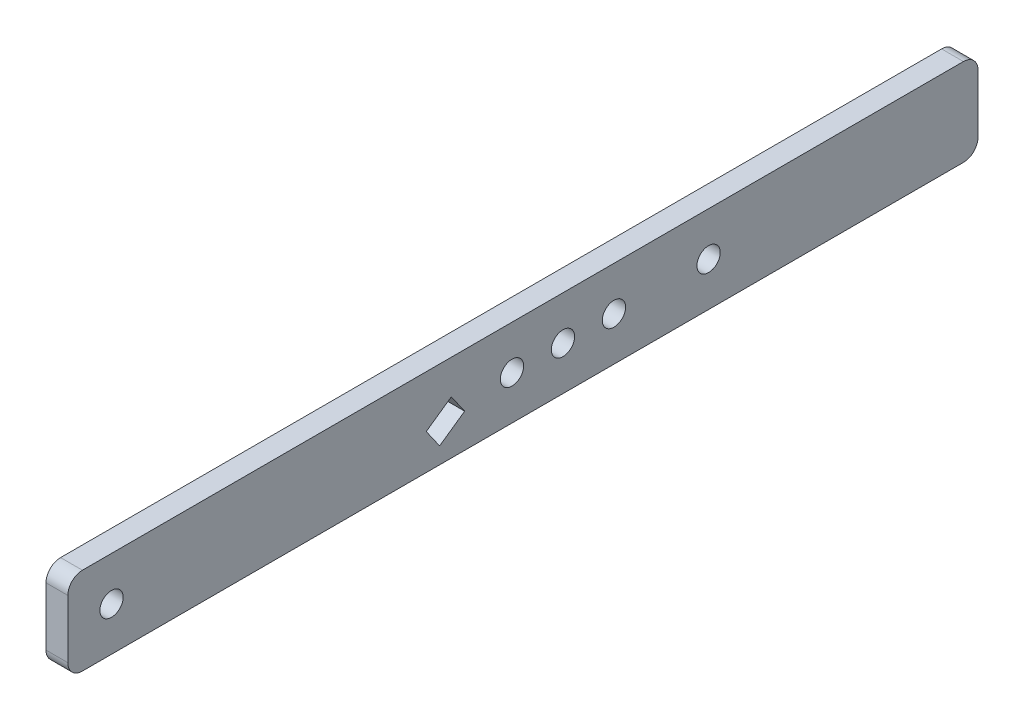
ISO-10303-21;
HEADER;
FILE_DESCRIPTION(('STEP AP214'),'2;1');
FILE_NAME('part.step','',(''),(''),'','','');
FILE_SCHEMA(('AUTOMOTIVE_DESIGN { 1 0 10303 214 1 1 1 1 }'));
ENDSEC;
DATA;
#1=APPLICATION_CONTEXT('core data for automotive mechanical design processes');
#2=APPLICATION_PROTOCOL_DEFINITION('international standard','automotive_design',2000,#1);
#3=PRODUCT_CONTEXT('',#1,'mechanical');
#4=PRODUCT('Part','Part','',(#3));
#5=PRODUCT_RELATED_PRODUCT_CATEGORY('part','',(#4));
#6=PRODUCT_DEFINITION_FORMATION('','',#4);
#7=PRODUCT_DEFINITION_CONTEXT('part definition',#1,'design');
#8=PRODUCT_DEFINITION('design','',#6,#7);
#9=PRODUCT_DEFINITION_SHAPE('','',#8);
#10=(LENGTH_UNIT() NAMED_UNIT(*) SI_UNIT(.MILLI.,.METRE.));
#11=(NAMED_UNIT(*) PLANE_ANGLE_UNIT() SI_UNIT($,.RADIAN.));
#12=(NAMED_UNIT(*) SI_UNIT($,.STERADIAN.) SOLID_ANGLE_UNIT());
#13=UNCERTAINTY_MEASURE_WITH_UNIT(LENGTH_MEASURE(1.E-05),#10,'distance_accuracy_value','');
#14=(GEOMETRIC_REPRESENTATION_CONTEXT(3) GLOBAL_UNCERTAINTY_ASSIGNED_CONTEXT((#13)) GLOBAL_UNIT_ASSIGNED_CONTEXT((#10,
#11,#12)) REPRESENTATION_CONTEXT('',''));
#15=CARTESIAN_POINT('',(0.,0.,0.));
#16=DIRECTION('',(0.,0.,1.));
#17=DIRECTION('',(1.,0.,0.));
#18=AXIS2_PLACEMENT_3D('',#15,#16,#17);
#19=CARTESIAN_POINT('',(55.,0.,-200.));
#20=DIRECTION('',(1.,0.,0.));
#21=DIRECTION('',(0.,0.,1.));
#22=AXIS2_PLACEMENT_3D('',#19,#20,#21);
#23=CYLINDRICAL_SURFACE('',#22,8.);
#24=CARTESIAN_POINT('',(39.9999999999997,0.,-200.));
#25=DIRECTION('',(-1.,0.,0.));
#26=DIRECTION('',(0.,0.,1.));
#27=AXIS2_PLACEMENT_3D('',#24,#25,#26);
#28=CIRCLE('',#27,8.);
#29=CARTESIAN_POINT('',(39.9999999999997,0.,-192.));
#30=VERTEX_POINT('',#29);
#31=EDGE_CURVE('E217',#30,#30,#28,.T.);
#32=ORIENTED_EDGE('',*,*,#31,.T.);
#33=EDGE_LOOP('',(#32));
#34=FACE_BOUND('',#33,.T.);
#35=CARTESIAN_POINT('',(55.,0.,-200.));
#36=DIRECTION('',(-1.,0.,0.));
#37=DIRECTION('',(0.,0.,1.));
#38=AXIS2_PLACEMENT_3D('',#35,#36,#37);
#39=CIRCLE('',#38,8.);
#40=CARTESIAN_POINT('',(55.,0.,-192.));
#41=VERTEX_POINT('',#40);
#42=EDGE_CURVE('E220',#41,#41,#39,.T.);
#43=ORIENTED_EDGE('',*,*,#42,.F.);
#44=EDGE_LOOP('',(#43));
#45=FACE_BOUND('',#44,.T.);
#46=ADVANCED_FACE('F41',(#34,#45),#23,.F.);
#47=CARTESIAN_POINT('',(55.,-30.0000000000005,-450.));
#48=DIRECTION('',(0.,1.,0.));
#49=DIRECTION('',(0.,0.,1.));
#50=AXIS2_PLACEMENT_3D('',#47,#48,#49);
#51=PLANE('',#50);
#52=DIRECTION('',(0.,0.,1.));
#53=VECTOR('',#52,1.);
#54=CARTESIAN_POINT('',(40.,-30.0000000000005,-450.));
#55=LINE('',#54,#53);
#56=CARTESIAN_POINT('',(40.,-30.0000000000005,-440.));
#57=VERTEX_POINT('',#56);
#58=CARTESIAN_POINT('',(40.,-30.0000000000005,165.));
#59=VERTEX_POINT('',#58);
#60=EDGE_CURVE('E195',#57,#59,#55,.T.);
#61=ORIENTED_EDGE('',*,*,#60,.F.);
#62=DIRECTION('',(1.,0.,0.));
#63=VECTOR('',#62,1.);
#64=CARTESIAN_POINT('',(55.,-30.0000000000005,-440.));
#65=LINE('',#64,#63);
#66=CARTESIAN_POINT('',(55.,-30.0000000000005,-440.));
#67=VERTEX_POINT('',#66);
#68=EDGE_CURVE('E223',#67,#57,#65,.F.);
#69=ORIENTED_EDGE('',*,*,#68,.F.);
#70=DIRECTION('',(0.,0.,1.));
#71=VECTOR('',#70,1.);
#72=CARTESIAN_POINT('',(55.,-30.0000000000005,-450.));
#73=LINE('',#72,#71);
#74=CARTESIAN_POINT('',(55.,-30.0000000000005,165.));
#75=VERTEX_POINT('',#74);
#76=EDGE_CURVE('E213',#67,#75,#73,.T.);
#77=ORIENTED_EDGE('',*,*,#76,.T.);
#78=DIRECTION('',(1.,0.,0.));
#79=VECTOR('',#78,1.);
#80=CARTESIAN_POINT('',(55.,-30.0000000000005,165.));
#81=LINE('',#80,#79);
#82=EDGE_CURVE('E226',#59,#75,#81,.T.);
#83=ORIENTED_EDGE('',*,*,#82,.F.);
#84=EDGE_LOOP('',(#61,#69,#77,#83));
#85=FACE_BOUND('',#84,.T.);
#86=ADVANCED_FACE('F291',(#85),#51,.F.);
#87=CARTESIAN_POINT('',(55.,-30.0000000000005,-450.));
#88=DIRECTION('',(-1.,0.,0.));
#89=DIRECTION('',(0.,0.,-1.));
#90=AXIS2_PLACEMENT_3D('',#87,#88,#89);
#91=PLANE('',#90);
#92=DIRECTION('',(0.,0.573576436351056,-0.819152044288984));
#93=VECTOR('',#92,1.);
#94=CARTESIAN_POINT('',(55.,-5.61297655954159,-71.1121153167902));
#95=LINE('',#94,#93);
#96=CARTESIAN_POINT('',(55.,-5.61297655954154,-71.1121153167902));
#97=VERTEX_POINT('',#96);
#98=CARTESIAN_POINT('',(55.,6.43212860383058,-88.3143082468588));
#99=VERTEX_POINT('',#98);
#100=EDGE_CURVE('E132',#97,#99,#95,.T.);
#101=ORIENTED_EDGE('',*,*,#100,.T.);
#102=DIRECTION('',(0.,-0.819152044288984,-0.573576436351057));
#103=VECTOR('',#102,1.);
#104=CARTESIAN_POINT('',(55.,6.43212860383058,-88.3143082468588));
#105=LINE('',#104,#103);
#106=CARTESIAN_POINT('',(55.,-6.67430410479316,-97.4915312284757));
#107=VERTEX_POINT('',#106);
#108=EDGE_CURVE('E139',#99,#107,#105,.T.);
#109=ORIENTED_EDGE('',*,*,#108,.T.);
#110=DIRECTION('',(0.,-0.573576436351057,0.819152044288984));
#111=VECTOR('',#110,1.);
#112=CARTESIAN_POINT('',(55.,-18.7194092681653,-80.2893382984071));
#113=LINE('',#112,#111);
#114=CARTESIAN_POINT('',(55.,-18.7194092681653,-80.2893382984071));
#115=VERTEX_POINT('',#114);
#116=EDGE_CURVE('E144',#107,#115,#113,.T.);
#117=ORIENTED_EDGE('',*,*,#116,.T.);
#118=DIRECTION('',(0.,0.819152044288984,0.573576436351057));
#119=VECTOR('',#118,1.);
#120=CARTESIAN_POINT('',(55.,-5.61297655954159,-71.1121153167902));
#121=LINE('',#120,#119);
#122=EDGE_CURVE('E148',#115,#97,#121,.T.);
#123=ORIENTED_EDGE('',*,*,#122,.T.);
#124=EDGE_LOOP('',(#101,#109,#117,#123));
#125=FACE_BOUND('',#124,.T.);
#126=CARTESIAN_POINT('',(55.,0.,-165.));
#127=DIRECTION('',(-1.,0.,0.));
#128=DIRECTION('',(0.,0.,1.));
#129=AXIS2_PLACEMENT_3D('',#126,#127,#128);
#130=CIRCLE('',#129,8.);
#131=CARTESIAN_POINT('',(55.,0.,-157.));
#132=VERTEX_POINT('',#131);
#133=EDGE_CURVE('E164',#132,#132,#130,.T.);
#134=ORIENTED_EDGE('',*,*,#133,.T.);
#135=EDGE_LOOP('',(#134));
#136=FACE_BOUND('',#135,.T.);
#137=CARTESIAN_POINT('',(55.,0.,-265.));
#138=DIRECTION('',(-1.,0.,0.));
#139=DIRECTION('',(0.,0.,1.));
#140=AXIS2_PLACEMENT_3D('',#137,#138,#139);
#141=CIRCLE('',#140,8.);
#142=CARTESIAN_POINT('',(55.,0.,-257.));
#143=VERTEX_POINT('',#142);
#144=EDGE_CURVE('E167',#143,#143,#141,.T.);
#145=ORIENTED_EDGE('',*,*,#144,.T.);
#146=EDGE_LOOP('',(#145));
#147=FACE_BOUND('',#146,.T.);
#148=CARTESIAN_POINT('',(55.,0.,-130.));
#149=DIRECTION('',(-1.,0.,0.));
#150=DIRECTION('',(0.,0.,1.));
#151=AXIS2_PLACEMENT_3D('',#148,#149,#150);
#152=CIRCLE('',#151,8.);
#153=CARTESIAN_POINT('',(55.,0.,-122.));
#154=VERTEX_POINT('',#153);
#155=EDGE_CURVE('E173',#154,#154,#152,.T.);
#156=ORIENTED_EDGE('',*,*,#155,.T.);
#157=EDGE_LOOP('',(#156));
#158=FACE_BOUND('',#157,.T.);
#159=CARTESIAN_POINT('',(55.,0.,145.));
#160=DIRECTION('',(-1.,0.,0.));
#161=DIRECTION('',(0.,0.,1.));
#162=AXIS2_PLACEMENT_3D('',#159,#160,#161);
#163=CIRCLE('',#162,8.);
#164=CARTESIAN_POINT('',(55.,0.,153.));
#165=VERTEX_POINT('',#164);
#166=EDGE_CURVE('E179',#165,#165,#163,.T.);
#167=ORIENTED_EDGE('',*,*,#166,.T.);
#168=EDGE_LOOP('',(#167));
#169=FACE_BOUND('',#168,.T.);
#170=ORIENTED_EDGE('',*,*,#76,.F.);
#171=CARTESIAN_POINT('',(55.,-20.0000000000005,-440.));
#172=DIRECTION('',(1.,0.,0.));
#173=DIRECTION('',(0.,0.,-1.));
#174=AXIS2_PLACEMENT_3D('',#171,#172,#173);
#175=CIRCLE('',#174,10.);
#176=CARTESIAN_POINT('',(55.,-20.0000000000005,-450.));
#177=VERTEX_POINT('',#176);
#178=EDGE_CURVE('E235',#177,#67,#175,.F.);
#179=ORIENTED_EDGE('',*,*,#178,.F.);
#180=DIRECTION('',(0.,1.,0.));
#181=VECTOR('',#180,1.);
#182=CARTESIAN_POINT('',(55.,-30.0000000000005,-450.));
#183=LINE('',#182,#181);
#184=CARTESIAN_POINT('',(55.,20.0000000000005,-450.));
#185=VERTEX_POINT('',#184);
#186=EDGE_CURVE('E186',#177,#185,#183,.T.);
#187=ORIENTED_EDGE('',*,*,#186,.T.);
#188=CARTESIAN_POINT('',(55.,20.0000000000005,-440.));
#189=DIRECTION('',(1.,0.,0.));
#190=DIRECTION('',(0.,0.,-1.));
#191=AXIS2_PLACEMENT_3D('',#188,#189,#190);
#192=CIRCLE('',#191,10.);
#193=CARTESIAN_POINT('',(55.,30.0000000000005,-440.));
#194=VERTEX_POINT('',#193);
#195=EDGE_CURVE('E232',#194,#185,#192,.F.);
#196=ORIENTED_EDGE('',*,*,#195,.F.);
#197=DIRECTION('',(0.,0.,1.));
#198=VECTOR('',#197,1.);
#199=CARTESIAN_POINT('',(55.,30.0000000000005,-450.));
#200=LINE('',#199,#198);
#201=CARTESIAN_POINT('',(55.,30.0000000000005,165.));
#202=VERTEX_POINT('',#201);
#203=EDGE_CURVE('E209',#194,#202,#200,.T.);
#204=ORIENTED_EDGE('',*,*,#203,.T.);
#205=CARTESIAN_POINT('',(55.,20.0000000000005,165.));
#206=DIRECTION('',(1.,0.,0.));
#207=DIRECTION('',(0.,0.,-1.));
#208=AXIS2_PLACEMENT_3D('',#205,#206,#207);
#209=CIRCLE('',#208,10.);
#210=CARTESIAN_POINT('',(55.,20.0000000000005,175.));
#211=VERTEX_POINT('',#210);
#212=EDGE_CURVE('E229',#211,#202,#209,.F.);
#213=ORIENTED_EDGE('',*,*,#212,.F.);
#214=DIRECTION('',(0.,1.,0.));
#215=VECTOR('',#214,1.);
#216=CARTESIAN_POINT('',(55.,-30.0000000000005,175.));
#217=LINE('',#216,#215);
#218=CARTESIAN_POINT('',(55.,-20.0000000000005,175.));
#219=VERTEX_POINT('',#218);
#220=EDGE_CURVE('E185',#219,#211,#217,.T.);
#221=ORIENTED_EDGE('',*,*,#220,.F.);
#222=CARTESIAN_POINT('',(55.,-20.0000000000005,165.));
#223=DIRECTION('',(1.,0.,0.));
#224=DIRECTION('',(0.,0.,-1.));
#225=AXIS2_PLACEMENT_3D('',#222,#223,#224);
#226=CIRCLE('',#225,10.);
#227=EDGE_CURVE('E237',#75,#219,#226,.F.);
#228=ORIENTED_EDGE('',*,*,#227,.F.);
#229=EDGE_LOOP('',(#170,#179,#187,#196,#204,#213,#221,#228));
#230=FACE_BOUND('',#229,.T.);
#231=ORIENTED_EDGE('',*,*,#42,.T.);
#232=EDGE_LOOP('',(#231));
#233=FACE_BOUND('',#232,.T.);
#234=ADVANCED_FACE('F146',(#125,#136,#147,#158,#169,#230,#233),#91,.F.);
#235=CARTESIAN_POINT('',(40.,30.0000000000005,-450.));
#236=DIRECTION('',(0.,-1.,0.));
#237=DIRECTION('',(0.,0.,-1.));
#238=AXIS2_PLACEMENT_3D('',#235,#236,#237);
#239=PLANE('',#238);
#240=DIRECTION('',(0.,0.,1.));
#241=VECTOR('',#240,1.);
#242=CARTESIAN_POINT('',(40.,30.0000000000005,-450.));
#243=LINE('',#242,#241);
#244=CARTESIAN_POINT('',(40.,30.0000000000005,-440.));
#245=VERTEX_POINT('',#244);
#246=CARTESIAN_POINT('',(40.,30.0000000000005,165.));
#247=VERTEX_POINT('',#246);
#248=EDGE_CURVE('E205',#245,#247,#243,.T.);
#249=ORIENTED_EDGE('',*,*,#248,.T.);
#250=DIRECTION('',(-1.,0.,0.));
#251=VECTOR('',#250,1.);
#252=CARTESIAN_POINT('',(40.,30.0000000000005,165.));
#253=LINE('',#252,#251);
#254=EDGE_CURVE('E49',#202,#247,#253,.T.);
#255=ORIENTED_EDGE('',*,*,#254,.F.);
#256=ORIENTED_EDGE('',*,*,#203,.F.);
#257=DIRECTION('',(-1.,0.,0.));
#258=VECTOR('',#257,1.);
#259=CARTESIAN_POINT('',(40.,30.0000000000005,-440.));
#260=LINE('',#259,#258);
#261=EDGE_CURVE('E11',#245,#194,#260,.F.);
#262=ORIENTED_EDGE('',*,*,#261,.F.);
#263=EDGE_LOOP('',(#249,#255,#256,#262));
#264=FACE_BOUND('',#263,.T.);
#265=ADVANCED_FACE('F265',(#264),#239,.F.);
#266=CARTESIAN_POINT('',(40.,-30.0000000000005,-450.));
#267=DIRECTION('',(1.,0.,0.));
#268=DIRECTION('',(0.,0.,1.));
#269=AXIS2_PLACEMENT_3D('',#266,#267,#268);
#270=PLANE('',#269);
#271=DIRECTION('',(0.,0.573576436351057,-0.819152044288984));
#272=VECTOR('',#271,1.);
#273=CARTESIAN_POINT('',(40.,-18.7194092681653,-80.2893382984071));
#274=LINE('',#273,#272);
#275=CARTESIAN_POINT('',(40.,-18.7194092681653,-80.2893382984071));
#276=VERTEX_POINT('',#275);
#277=CARTESIAN_POINT('',(40.,-6.67430410479316,-97.4915312284757));
#278=VERTEX_POINT('',#277);
#279=EDGE_CURVE('E350',#276,#278,#274,.T.);
#280=ORIENTED_EDGE('',*,*,#279,.T.);
#281=DIRECTION('',(0.,0.819152044288984,0.573576436351057));
#282=VECTOR('',#281,1.);
#283=CARTESIAN_POINT('',(40.,6.43212860383058,-88.3143082468588));
#284=LINE('',#283,#282);
#285=CARTESIAN_POINT('',(40.,6.43212860383061,-88.3143082468588));
#286=VERTEX_POINT('',#285);
#287=EDGE_CURVE('E156',#278,#286,#284,.T.);
#288=ORIENTED_EDGE('',*,*,#287,.T.);
#289=DIRECTION('',(0.,-0.573576436351057,0.819152044288984));
#290=VECTOR('',#289,1.);
#291=CARTESIAN_POINT('',(40.,-5.61297655954159,-71.1121153167902));
#292=LINE('',#291,#290);
#293=CARTESIAN_POINT('',(40.,-5.61297655954159,-71.1121153167902));
#294=VERTEX_POINT('',#293);
#295=EDGE_CURVE('E134',#286,#294,#292,.T.);
#296=ORIENTED_EDGE('',*,*,#295,.T.);
#297=DIRECTION('',(0.,-0.819152044288984,-0.573576436351057));
#298=VECTOR('',#297,1.);
#299=CARTESIAN_POINT('',(40.,-5.61297655954159,-71.1121153167902));
#300=LINE('',#299,#298);
#301=EDGE_CURVE('E161',#294,#276,#300,.T.);
#302=ORIENTED_EDGE('',*,*,#301,.T.);
#303=EDGE_LOOP('',(#280,#288,#296,#302));
#304=FACE_BOUND('',#303,.T.);
#305=CARTESIAN_POINT('',(39.9999999999997,0.,-165.));
#306=DIRECTION('',(-1.,0.,0.));
#307=DIRECTION('',(0.,0.,1.));
#308=AXIS2_PLACEMENT_3D('',#305,#306,#307);
#309=CIRCLE('',#308,8.);
#310=CARTESIAN_POINT('',(39.9999999999997,0.,-157.));
#311=VERTEX_POINT('',#310);
#312=EDGE_CURVE('E160',#311,#311,#309,.T.);
#313=ORIENTED_EDGE('',*,*,#312,.F.);
#314=EDGE_LOOP('',(#313));
#315=FACE_BOUND('',#314,.T.);
#316=CARTESIAN_POINT('',(39.9999999999995,0.,-265.));
#317=DIRECTION('',(-1.,0.,0.));
#318=DIRECTION('',(0.,0.,1.));
#319=AXIS2_PLACEMENT_3D('',#316,#317,#318);
#320=CIRCLE('',#319,8.);
#321=CARTESIAN_POINT('',(39.9999999999995,0.,-257.));
#322=VERTEX_POINT('',#321);
#323=EDGE_CURVE('E170',#322,#322,#320,.T.);
#324=ORIENTED_EDGE('',*,*,#323,.F.);
#325=EDGE_LOOP('',(#324));
#326=FACE_BOUND('',#325,.T.);
#327=CARTESIAN_POINT('',(39.9999999999997,0.,-130.));
#328=DIRECTION('',(-1.,0.,0.));
#329=DIRECTION('',(0.,0.,1.));
#330=AXIS2_PLACEMENT_3D('',#327,#328,#329);
#331=CIRCLE('',#330,8.);
#332=CARTESIAN_POINT('',(39.9999999999997,0.,-122.));
#333=VERTEX_POINT('',#332);
#334=EDGE_CURVE('E176',#333,#333,#331,.T.);
#335=ORIENTED_EDGE('',*,*,#334,.F.);
#336=EDGE_LOOP('',(#335));
#337=FACE_BOUND('',#336,.T.);
#338=CARTESIAN_POINT('',(39.9999999999998,0.,145.));
#339=DIRECTION('',(-1.,0.,0.));
#340=DIRECTION('',(0.,0.,1.));
#341=AXIS2_PLACEMENT_3D('',#338,#339,#340);
#342=CIRCLE('',#341,8.);
#343=CARTESIAN_POINT('',(39.9999999999998,0.,153.));
#344=VERTEX_POINT('',#343);
#345=EDGE_CURVE('E182',#344,#344,#342,.T.);
#346=ORIENTED_EDGE('',*,*,#345,.F.);
#347=EDGE_LOOP('',(#346));
#348=FACE_BOUND('',#347,.T.);
#349=DIRECTION('',(0.,-1.,0.));
#350=VECTOR('',#349,1.);
#351=CARTESIAN_POINT('',(40.,-30.0000000000005,175.));
#352=LINE('',#351,#350);
#353=CARTESIAN_POINT('',(40.,20.0000000000005,175.));
#354=VERTEX_POINT('',#353);
#355=CARTESIAN_POINT('',(40.,-20.0000000000005,175.));
#356=VERTEX_POINT('',#355);
#357=EDGE_CURVE('E191',#354,#356,#352,.T.);
#358=ORIENTED_EDGE('',*,*,#357,.F.);
#359=CARTESIAN_POINT('',(40.,20.0000000000005,165.));
#360=DIRECTION('',(-1.,0.,0.));
#361=DIRECTION('',(0.,0.,1.));
#362=AXIS2_PLACEMENT_3D('',#359,#360,#361);
#363=CIRCLE('',#362,10.);
#364=EDGE_CURVE('E244',#247,#354,#363,.F.);
#365=ORIENTED_EDGE('',*,*,#364,.F.);
#366=ORIENTED_EDGE('',*,*,#248,.F.);
#367=CARTESIAN_POINT('',(40.,20.0000000000005,-440.));
#368=DIRECTION('',(-1.,0.,0.));
#369=DIRECTION('',(0.,0.,1.));
#370=AXIS2_PLACEMENT_3D('',#367,#368,#369);
#371=CIRCLE('',#370,10.);
#372=CARTESIAN_POINT('',(40.,20.0000000000005,-450.));
#373=VERTEX_POINT('',#372);
#374=EDGE_CURVE('E247',#373,#245,#371,.F.);
#375=ORIENTED_EDGE('',*,*,#374,.F.);
#376=DIRECTION('',(0.,-1.,0.));
#377=VECTOR('',#376,1.);
#378=CARTESIAN_POINT('',(40.,-30.0000000000005,-450.));
#379=LINE('',#378,#377);
#380=CARTESIAN_POINT('',(40.,-20.0000000000005,-450.));
#381=VERTEX_POINT('',#380);
#382=EDGE_CURVE('E190',#373,#381,#379,.T.);
#383=ORIENTED_EDGE('',*,*,#382,.T.);
#384=CARTESIAN_POINT('',(40.,-20.0000000000005,-440.));
#385=DIRECTION('',(-1.,0.,0.));
#386=DIRECTION('',(0.,0.,1.));
#387=AXIS2_PLACEMENT_3D('',#384,#385,#386);
#388=CIRCLE('',#387,10.);
#389=EDGE_CURVE('E249',#57,#381,#388,.F.);
#390=ORIENTED_EDGE('',*,*,#389,.F.);
#391=ORIENTED_EDGE('',*,*,#60,.T.);
#392=CARTESIAN_POINT('',(40.,-20.0000000000005,165.));
#393=DIRECTION('',(-1.,0.,0.));
#394=DIRECTION('',(0.,0.,1.));
#395=AXIS2_PLACEMENT_3D('',#392,#393,#394);
#396=CIRCLE('',#395,10.);
#397=EDGE_CURVE('E252',#356,#59,#396,.F.);
#398=ORIENTED_EDGE('',*,*,#397,.F.);
#399=EDGE_LOOP('',(#358,#365,#366,#375,#383,#390,#391,#398));
#400=FACE_BOUND('',#399,.T.);
#401=ORIENTED_EDGE('',*,*,#31,.F.);
#402=EDGE_LOOP('',(#401));
#403=FACE_BOUND('',#402,.T.);
#404=ADVANCED_FACE('F268',(#304,#315,#326,#337,#348,#400,#403),#270,.F.);
#405=CARTESIAN_POINT('',(7.50000000000007,0.,-450.));
#406=DIRECTION('',(0.,0.,1.));
#407=DIRECTION('',(-1.,0.,0.));
#408=AXIS2_PLACEMENT_3D('',#405,#406,#407);
#409=PLANE('',#408);
#410=ORIENTED_EDGE('',*,*,#382,.F.);
#411=DIRECTION('',(-1.,0.,0.));
#412=VECTOR('',#411,1.);
#413=CARTESIAN_POINT('',(7.50000000000007,20.0000000000005,-450.));
#414=LINE('',#413,#412);
#415=EDGE_CURVE('E254',#185,#373,#414,.T.);
#416=ORIENTED_EDGE('',*,*,#415,.F.);
#417=ORIENTED_EDGE('',*,*,#186,.F.);
#418=DIRECTION('',(1.,0.,0.));
#419=VECTOR('',#418,1.);
#420=CARTESIAN_POINT('',(7.50000000000007,-20.0000000000005,-450.));
#421=LINE('',#420,#419);
#422=EDGE_CURVE('E256',#381,#177,#421,.T.);
#423=ORIENTED_EDGE('',*,*,#422,.F.);
#424=EDGE_LOOP('',(#410,#416,#417,#423));
#425=FACE_BOUND('',#424,.T.);
#426=ADVANCED_FACE('F284',(#425),#409,.F.);
#427=CARTESIAN_POINT('',(7.5,0.,175.));
#428=DIRECTION('',(0.,0.,1.));
#429=DIRECTION('',(-1.,0.,0.));
#430=AXIS2_PLACEMENT_3D('',#427,#428,#429);
#431=PLANE('',#430);
#432=ORIENTED_EDGE('',*,*,#220,.T.);
#433=DIRECTION('',(-1.,0.,0.));
#434=VECTOR('',#433,1.);
#435=CARTESIAN_POINT('',(55.,20.0000000000005,175.));
#436=LINE('',#435,#434);
#437=EDGE_CURVE('E240',#354,#211,#436,.F.);
#438=ORIENTED_EDGE('',*,*,#437,.F.);
#439=ORIENTED_EDGE('',*,*,#357,.T.);
#440=DIRECTION('',(1.,0.,0.));
#441=VECTOR('',#440,1.);
#442=CARTESIAN_POINT('',(40.,-20.0000000000005,175.));
#443=LINE('',#442,#441);
#444=EDGE_CURVE('E242',#219,#356,#443,.F.);
#445=ORIENTED_EDGE('',*,*,#444,.F.);
#446=EDGE_LOOP('',(#432,#438,#439,#445));
#447=FACE_BOUND('',#446,.T.);
#448=ADVANCED_FACE('F272',(#447),#431,.T.);
#449=CARTESIAN_POINT('',(55.,0.,145.));
#450=DIRECTION('',(1.,0.,0.));
#451=DIRECTION('',(0.,0.,1.));
#452=AXIS2_PLACEMENT_3D('',#449,#450,#451);
#453=CYLINDRICAL_SURFACE('',#452,8.);
#454=ORIENTED_EDGE('',*,*,#345,.T.);
#455=EDGE_LOOP('',(#454));
#456=FACE_BOUND('',#455,.T.);
#457=ORIENTED_EDGE('',*,*,#166,.F.);
#458=EDGE_LOOP('',(#457));
#459=FACE_BOUND('',#458,.T.);
#460=ADVANCED_FACE('F323',(#456,#459),#453,.F.);
#461=CARTESIAN_POINT('',(55.,0.,-130.));
#462=DIRECTION('',(1.,0.,0.));
#463=DIRECTION('',(0.,0.,1.));
#464=AXIS2_PLACEMENT_3D('',#461,#462,#463);
#465=CYLINDRICAL_SURFACE('',#464,8.);
#466=ORIENTED_EDGE('',*,*,#334,.T.);
#467=EDGE_LOOP('',(#466));
#468=FACE_BOUND('',#467,.T.);
#469=ORIENTED_EDGE('',*,*,#155,.F.);
#470=EDGE_LOOP('',(#469));
#471=FACE_BOUND('',#470,.T.);
#472=ADVANCED_FACE('F328',(#468,#471),#465,.F.);
#473=CARTESIAN_POINT('',(55.,0.,-265.));
#474=DIRECTION('',(1.,0.,0.));
#475=DIRECTION('',(0.,0.,1.));
#476=AXIS2_PLACEMENT_3D('',#473,#474,#475);
#477=CYLINDRICAL_SURFACE('',#476,8.);
#478=ORIENTED_EDGE('',*,*,#323,.T.);
#479=EDGE_LOOP('',(#478));
#480=FACE_BOUND('',#479,.T.);
#481=ORIENTED_EDGE('',*,*,#144,.F.);
#482=EDGE_LOOP('',(#481));
#483=FACE_BOUND('',#482,.T.);
#484=ADVANCED_FACE('F302',(#480,#483),#477,.F.);
#485=CARTESIAN_POINT('',(55.,0.,-165.));
#486=DIRECTION('',(1.,0.,0.));
#487=DIRECTION('',(0.,0.,1.));
#488=AXIS2_PLACEMENT_3D('',#485,#486,#487);
#489=CYLINDRICAL_SURFACE('',#488,8.);
#490=ORIENTED_EDGE('',*,*,#312,.T.);
#491=EDGE_LOOP('',(#490));
#492=FACE_BOUND('',#491,.T.);
#493=ORIENTED_EDGE('',*,*,#133,.F.);
#494=EDGE_LOOP('',(#493));
#495=FACE_BOUND('',#494,.T.);
#496=ADVANCED_FACE('F295',(#492,#495),#489,.F.);
#497=CARTESIAN_POINT('',(55.,-20.0000000000005,165.));
#498=DIRECTION('',(-1.,0.,0.));
#499=DIRECTION('',(0.,0.,-1.));
#500=AXIS2_PLACEMENT_3D('',#497,#498,#499);
#501=CYLINDRICAL_SURFACE('',#500,10.);
#502=ORIENTED_EDGE('',*,*,#397,.T.);
#503=ORIENTED_EDGE('',*,*,#82,.T.);
#504=ORIENTED_EDGE('',*,*,#227,.T.);
#505=ORIENTED_EDGE('',*,*,#444,.T.);
#506=EDGE_LOOP('',(#502,#503,#504,#505));
#507=FACE_BOUND('',#506,.T.);
#508=ADVANCED_FACE('F293',(#507),#501,.T.);
#509=CARTESIAN_POINT('',(7.50000000000007,-20.0000000000005,-440.));
#510=DIRECTION('',(1.,0.,0.));
#511=DIRECTION('',(0.,0.,1.));
#512=AXIS2_PLACEMENT_3D('',#509,#510,#511);
#513=CYLINDRICAL_SURFACE('',#512,10.);
#514=ORIENTED_EDGE('',*,*,#389,.T.);
#515=ORIENTED_EDGE('',*,*,#422,.T.);
#516=ORIENTED_EDGE('',*,*,#178,.T.);
#517=ORIENTED_EDGE('',*,*,#68,.T.);
#518=EDGE_LOOP('',(#514,#515,#516,#517));
#519=FACE_BOUND('',#518,.T.);
#520=ADVANCED_FACE('F288',(#519),#513,.T.);
#521=CARTESIAN_POINT('',(7.50000000000007,20.0000000000005,-440.));
#522=DIRECTION('',(-1.,0.,0.));
#523=DIRECTION('',(0.,0.,-1.));
#524=AXIS2_PLACEMENT_3D('',#521,#522,#523);
#525=CYLINDRICAL_SURFACE('',#524,10.);
#526=ORIENTED_EDGE('',*,*,#195,.T.);
#527=ORIENTED_EDGE('',*,*,#415,.T.);
#528=ORIENTED_EDGE('',*,*,#374,.T.);
#529=ORIENTED_EDGE('',*,*,#261,.T.);
#530=EDGE_LOOP('',(#526,#527,#528,#529));
#531=FACE_BOUND('',#530,.T.);
#532=ADVANCED_FACE('F281',(#531),#525,.T.);
#533=CARTESIAN_POINT('',(40.,20.0000000000005,165.));
#534=DIRECTION('',(1.,0.,0.));
#535=DIRECTION('',(0.,0.,1.));
#536=AXIS2_PLACEMENT_3D('',#533,#534,#535);
#537=CYLINDRICAL_SURFACE('',#536,10.);
#538=ORIENTED_EDGE('',*,*,#212,.T.);
#539=ORIENTED_EDGE('',*,*,#254,.T.);
#540=ORIENTED_EDGE('',*,*,#364,.T.);
#541=ORIENTED_EDGE('',*,*,#437,.T.);
#542=EDGE_LOOP('',(#538,#539,#540,#541));
#543=FACE_BOUND('',#542,.T.);
#544=ADVANCED_FACE('F43',(#543),#537,.T.);
#545=CARTESIAN_POINT('',(3.55177039734121,-5.61297655954159,-71.1121153167902));
#546=DIRECTION('',(0.,-0.573576436351057,0.819152044288984));
#547=DIRECTION('',(0.,-0.819152044288984,-0.573576436351057));
#548=AXIS2_PLACEMENT_3D('',#545,#546,#547);
#549=PLANE('',#548);
#550=ORIENTED_EDGE('',*,*,#301,.F.);
#551=DIRECTION('',(1.,0.,0.));
#552=VECTOR('',#551,1.);
#553=CARTESIAN_POINT('',(3.55177039734121,-5.61297655954159,-71.1121153167902));
#554=LINE('',#553,#552);
#555=EDGE_CURVE('E56',#294,#97,#554,.T.);
#556=ORIENTED_EDGE('',*,*,#555,.T.);
#557=ORIENTED_EDGE('',*,*,#122,.F.);
#558=DIRECTION('',(1.,0.,0.));
#559=VECTOR('',#558,1.);
#560=CARTESIAN_POINT('',(3.55177039734121,-18.7194092681653,-80.2893382984071));
#561=LINE('',#560,#559);
#562=EDGE_CURVE('E154',#276,#115,#561,.T.);
#563=ORIENTED_EDGE('',*,*,#562,.F.);
#564=EDGE_LOOP('',(#550,#556,#557,#563));
#565=FACE_BOUND('',#564,.T.);
#566=ADVANCED_FACE('F336',(#565),#549,.F.);
#567=CARTESIAN_POINT('',(3.55177039734121,-18.7194092681653,-80.2893382984071));
#568=DIRECTION('',(0.,-0.819152044288984,-0.573576436351057));
#569=DIRECTION('',(0.,0.573576436351057,-0.819152044288984));
#570=AXIS2_PLACEMENT_3D('',#567,#568,#569);
#571=PLANE('',#570);
#572=ORIENTED_EDGE('',*,*,#279,.F.);
#573=ORIENTED_EDGE('',*,*,#562,.T.);
#574=ORIENTED_EDGE('',*,*,#116,.F.);
#575=DIRECTION('',(1.,0.,0.));
#576=VECTOR('',#575,1.);
#577=CARTESIAN_POINT('',(3.55177039734122,-6.67430410479316,-97.4915312284757));
#578=LINE('',#577,#576);
#579=EDGE_CURVE('E136',#278,#107,#578,.T.);
#580=ORIENTED_EDGE('',*,*,#579,.F.);
#581=EDGE_LOOP('',(#572,#573,#574,#580));
#582=FACE_BOUND('',#581,.T.);
#583=ADVANCED_FACE('F339',(#582),#571,.F.);
#584=CARTESIAN_POINT('',(3.55177039734122,6.43212860383058,-88.3143082468588));
#585=DIRECTION('',(0.,0.573576436351057,-0.819152044288984));
#586=DIRECTION('',(0.,0.819152044288984,0.573576436351057));
#587=AXIS2_PLACEMENT_3D('',#584,#585,#586);
#588=PLANE('',#587);
#589=ORIENTED_EDGE('',*,*,#287,.F.);
#590=ORIENTED_EDGE('',*,*,#579,.T.);
#591=ORIENTED_EDGE('',*,*,#108,.F.);
#592=DIRECTION('',(1.,0.,0.));
#593=VECTOR('',#592,1.);
#594=CARTESIAN_POINT('',(3.55177039734122,6.43212860383058,-88.3143082468588));
#595=LINE('',#594,#593);
#596=EDGE_CURVE('E64',#286,#99,#595,.T.);
#597=ORIENTED_EDGE('',*,*,#596,.F.);
#598=EDGE_LOOP('',(#589,#590,#591,#597));
#599=FACE_BOUND('',#598,.T.);
#600=ADVANCED_FACE('F140',(#599),#588,.F.);
#601=CARTESIAN_POINT('',(3.55177039734121,-5.61297655954159,-71.1121153167902));
#602=DIRECTION('',(0.,0.819152044288984,0.573576436351057));
#603=DIRECTION('',(0.,-0.573576436351057,0.819152044288984));
#604=AXIS2_PLACEMENT_3D('',#601,#602,#603);
#605=PLANE('',#604);
#606=ORIENTED_EDGE('',*,*,#295,.F.);
#607=ORIENTED_EDGE('',*,*,#596,.T.);
#608=ORIENTED_EDGE('',*,*,#100,.F.);
#609=ORIENTED_EDGE('',*,*,#555,.F.);
#610=EDGE_LOOP('',(#606,#607,#608,#609));
#611=FACE_BOUND('',#610,.T.);
#612=ADVANCED_FACE('F130',(#611),#605,.F.);
#613=CLOSED_SHELL('',(#46,#86,#234,#265,#404,#426,#448,#460,#472,#484,#496,#508,#520,#532,#544,
#566,#583,#600,#612));
#614=MANIFOLD_SOLID_BREP('B2',#613);
#615=ADVANCED_BREP_SHAPE_REPRESENTATION('',(#18,#614),#14);
#616=SHAPE_DEFINITION_REPRESENTATION(#9,#615);
ENDSEC;
END-ISO-10303-21;
